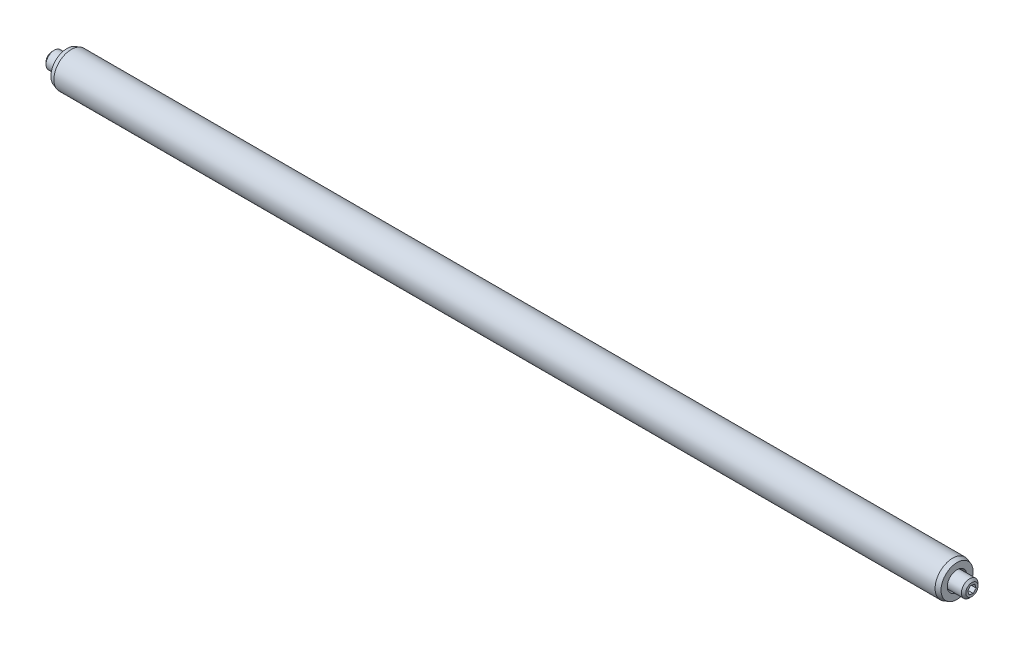
ISO-10303-21;
HEADER;
FILE_DESCRIPTION(('STEP AP214'),'2;1');
FILE_NAME('part.step','',(''),(''),'','','');
FILE_SCHEMA(('AUTOMOTIVE_DESIGN { 1 0 10303 214 1 1 1 1 }'));
ENDSEC;
DATA;
#1=APPLICATION_CONTEXT('core data for automotive mechanical design processes');
#2=APPLICATION_PROTOCOL_DEFINITION('international standard','automotive_design',2000,#1);
#3=PRODUCT_CONTEXT('',#1,'mechanical');
#4=PRODUCT('Part','Part','',(#3));
#5=PRODUCT_RELATED_PRODUCT_CATEGORY('part','',(#4));
#6=PRODUCT_DEFINITION_FORMATION('','',#4);
#7=PRODUCT_DEFINITION_CONTEXT('part definition',#1,'design');
#8=PRODUCT_DEFINITION('design','',#6,#7);
#9=PRODUCT_DEFINITION_SHAPE('','',#8);
#10=(LENGTH_UNIT() NAMED_UNIT(*) SI_UNIT(.MILLI.,.METRE.));
#11=(NAMED_UNIT(*) PLANE_ANGLE_UNIT() SI_UNIT($,.RADIAN.));
#12=(NAMED_UNIT(*) SI_UNIT($,.STERADIAN.) SOLID_ANGLE_UNIT());
#13=UNCERTAINTY_MEASURE_WITH_UNIT(LENGTH_MEASURE(1.E-05),#10,'distance_accuracy_value','');
#14=(GEOMETRIC_REPRESENTATION_CONTEXT(3) GLOBAL_UNCERTAINTY_ASSIGNED_CONTEXT((#13)) GLOBAL_UNIT_ASSIGNED_CONTEXT((#10,
#11,#12)) REPRESENTATION_CONTEXT('',''));
#15=CARTESIAN_POINT('',(0.,0.,0.));
#16=DIRECTION('',(0.,0.,1.));
#17=DIRECTION('',(1.,0.,0.));
#18=AXIS2_PLACEMENT_3D('',#15,#16,#17);
#19=CARTESIAN_POINT('',(-63.7071962136417,18.5557811677768,17.6600868446712));
#20=DIRECTION('',(-1.,0.,0.));
#21=DIRECTION('',(0.,-1.,0.));
#22=AXIS2_PLACEMENT_3D('',#19,#20,#21);
#23=CYLINDRICAL_SURFACE('',#22,2.99974000000001);
#24=CARTESIAN_POINT('',(-62.9451962136417,18.5557811677768,17.6600868446712));
#25=DIRECTION('',(-1.,0.,0.));
#26=DIRECTION('',(0.,-1.,0.));
#27=AXIS2_PLACEMENT_3D('',#24,#25,#26);
#28=CIRCLE('',#27,2.99974000000001);
#29=CARTESIAN_POINT('',(-62.9451962136417,15.5560411677768,17.6600868446712));
#30=VERTEX_POINT('',#29);
#31=EDGE_CURVE('P0_E63',#30,#30,#28,.T.);
#32=ORIENTED_EDGE('',*,*,#31,.F.);
#33=EDGE_LOOP('',(#32));
#34=FACE_BOUND('',#33,.T.);
#35=CARTESIAN_POINT('',(87.9308037863583,18.5557811677768,17.6600868446712));
#36=DIRECTION('',(-1.,0.,0.));
#37=DIRECTION('',(0.,-1.,0.));
#38=AXIS2_PLACEMENT_3D('',#35,#36,#37);
#39=CIRCLE('',#38,2.99974000000001);
#40=CARTESIAN_POINT('',(87.9308037863583,15.5560411677768,17.6600868446712));
#41=VERTEX_POINT('',#40);
#42=EDGE_CURVE('P0_E54',#41,#41,#39,.T.);
#43=ORIENTED_EDGE('',*,*,#42,.T.);
#44=EDGE_LOOP('',(#43));
#45=FACE_BOUND('',#44,.T.);
#46=ADVANCED_FACE('P0_F15',(#34,#45),#23,.T.);
#47=CARTESIAN_POINT('',(-62.9451962136417,18.5557811677768,17.6600868446712));
#48=DIRECTION('',(1.,0.,0.));
#49=DIRECTION('',(0.,1.,0.));
#50=AXIS2_PLACEMENT_3D('',#47,#48,#49);
#51=CONICAL_SURFACE('',#50,2.99974000000001,0.32175055439668);
#52=CARTESIAN_POINT('',(-63.7071962136417,18.5557811677768,17.6600868446712));
#53=DIRECTION('',(-1.,0.,0.));
#54=DIRECTION('',(0.,-1.,0.));
#55=AXIS2_PLACEMENT_3D('',#52,#53,#54);
#56=CIRCLE('',#55,2.74574);
#57=CARTESIAN_POINT('',(-63.7071962136417,15.8100411677768,17.6600868446712));
#58=VERTEX_POINT('',#57);
#59=EDGE_CURVE('P0_E60',#58,#58,#56,.T.);
#60=ORIENTED_EDGE('',*,*,#59,.F.);
#61=EDGE_LOOP('',(#60));
#62=FACE_BOUND('',#61,.T.);
#63=ORIENTED_EDGE('',*,*,#31,.T.);
#64=EDGE_LOOP('',(#63));
#65=FACE_BOUND('',#64,.T.);
#66=ADVANCED_FACE('P0_F91',(#62,#65),#51,.T.);
#67=CARTESIAN_POINT('',(-63.7071962136417,18.5557811677768,17.6600868446712));
#68=DIRECTION('',(1.,0.,0.));
#69=DIRECTION('',(0.,1.,0.));
#70=AXIS2_PLACEMENT_3D('',#67,#68,#69);
#71=PLANE('',#70);
#72=CARTESIAN_POINT('',(-63.7071962136417,18.5557811677768,17.6600868446712));
#73=DIRECTION('',(1.,0.,0.));
#74=DIRECTION('',(0.,1.,0.));
#75=AXIS2_PLACEMENT_3D('',#72,#73,#74);
#76=CIRCLE('',#75,1.67639999999998);
#77=CARTESIAN_POINT('',(-63.7071962136417,20.2321811677768,17.6600868446712));
#78=VERTEX_POINT('',#77);
#79=EDGE_CURVE('P0_E69',#78,#78,#76,.T.);
#80=ORIENTED_EDGE('',*,*,#79,.T.);
#81=EDGE_LOOP('',(#80));
#82=FACE_BOUND('',#81,.T.);
#83=ORIENTED_EDGE('',*,*,#59,.T.);
#84=EDGE_LOOP('',(#83));
#85=FACE_BOUND('',#84,.T.);
#86=ADVANCED_FACE('P0_F97',(#82,#85),#71,.F.);
#87=CARTESIAN_POINT('',(88.6928037863583,18.5557811677768,17.6600868446712));
#88=DIRECTION('',(-1.,0.,0.));
#89=DIRECTION('',(0.,-1.,0.));
#90=AXIS2_PLACEMENT_3D('',#87,#88,#89);
#91=PLANE('',#90);
#92=CARTESIAN_POINT('',(88.6928037863583,18.5557811677768,17.6600868446712));
#93=DIRECTION('',(-1.,0.,0.));
#94=DIRECTION('',(0.,-1.,0.));
#95=AXIS2_PLACEMENT_3D('',#92,#93,#94);
#96=CIRCLE('',#95,1.67639999999998);
#97=CARTESIAN_POINT('',(88.6928037863583,16.8793811677768,17.6600868446712));
#98=VERTEX_POINT('',#97);
#99=EDGE_CURVE('P0_E10',#98,#98,#96,.T.);
#100=ORIENTED_EDGE('',*,*,#99,.T.);
#101=EDGE_LOOP('',(#100));
#102=FACE_BOUND('',#101,.T.);
#103=CARTESIAN_POINT('',(88.6928037863583,18.5557811677768,17.6600868446712));
#104=DIRECTION('',(-1.,0.,0.));
#105=DIRECTION('',(0.,-1.,0.));
#106=AXIS2_PLACEMENT_3D('',#103,#104,#105);
#107=CIRCLE('',#106,2.74574000000001);
#108=CARTESIAN_POINT('',(88.6928037863583,15.8100411677768,17.6600868446712));
#109=VERTEX_POINT('',#108);
#110=EDGE_CURVE('P0_E57',#109,#109,#107,.T.);
#111=ORIENTED_EDGE('',*,*,#110,.F.);
#112=EDGE_LOOP('',(#111));
#113=FACE_BOUND('',#112,.T.);
#114=ADVANCED_FACE('P0_F107',(#102,#113),#91,.F.);
#115=CARTESIAN_POINT('',(88.6928037863583,18.5557811677768,17.6600868446712));
#116=DIRECTION('',(-1.,0.,0.));
#117=DIRECTION('',(0.,-1.,0.));
#118=AXIS2_PLACEMENT_3D('',#115,#116,#117);
#119=CONICAL_SURFACE('',#118,2.74574000000001,0.321750554396653);
#120=ORIENTED_EDGE('',*,*,#42,.F.);
#121=EDGE_LOOP('',(#120));
#122=FACE_BOUND('',#121,.T.);
#123=ORIENTED_EDGE('',*,*,#110,.T.);
#124=EDGE_LOOP('',(#123));
#125=FACE_BOUND('',#124,.T.);
#126=ADVANCED_FACE('P0_F103',(#122,#125),#119,.T.);
#127=CARTESIAN_POINT('',(84.7558037863583,18.5557811677768,17.6600868446712));
#128=DIRECTION('',(1.,0.,0.));
#129=DIRECTION('',(0.,0.,-1.));
#130=AXIS2_PLACEMENT_3D('',#127,#128,#129);
#131=CONICAL_SURFACE('',#130,1.1303,1.02974425867666);
#132=CARTESIAN_POINT('',(84.0766510286715,18.5557811677768,17.6600868446712));
#133=VERTEX_POINT('',#132);
#134=VERTEX_LOOP('',#133);
#135=FACE_BOUND('',#134,.T.);
#136=CARTESIAN_POINT('',(84.7558037863583,18.5557811677768,17.6600868446712));
#137=DIRECTION('',(1.,0.,0.));
#138=DIRECTION('',(0.,0.,-1.));
#139=AXIS2_PLACEMENT_3D('',#136,#137,#138);
#140=CIRCLE('',#139,1.1303);
#141=CARTESIAN_POINT('',(84.7558037863583,18.5557811677768,16.5297868446712));
#142=VERTEX_POINT('',#141);
#143=EDGE_CURVE('P0_E51',#142,#142,#140,.T.);
#144=ORIENTED_EDGE('',*,*,#143,.T.);
#145=EDGE_LOOP('',(#144));
#146=FACE_BOUND('',#145,.T.);
#147=ADVANCED_FACE('P0_F106',(#135,#146),#131,.F.);
#148=CARTESIAN_POINT('',(88.6928037863583,18.5557811677768,17.6600868446712));
#149=DIRECTION('',(1.,0.,0.));
#150=DIRECTION('',(0.,0.,-1.));
#151=AXIS2_PLACEMENT_3D('',#148,#149,#150);
#152=CYLINDRICAL_SURFACE('',#151,1.1303);
#153=ORIENTED_EDGE('',*,*,#143,.F.);
#154=EDGE_LOOP('',(#153));
#155=FACE_BOUND('',#154,.T.);
#156=CARTESIAN_POINT('',(84.8828037863583,18.5557811677768,17.6600868446712));
#157=DIRECTION('',(1.,0.,0.));
#158=DIRECTION('',(0.,0.,-1.));
#159=AXIS2_PLACEMENT_3D('',#156,#157,#158);
#160=CIRCLE('',#159,1.1303);
#161=CARTESIAN_POINT('',(84.8828037863583,18.5557811677768,16.5297868446712));
#162=VERTEX_POINT('',#161);
#163=EDGE_CURVE('P0_E42',#162,#162,#160,.T.);
#164=ORIENTED_EDGE('',*,*,#163,.T.);
#165=EDGE_LOOP('',(#164));
#166=FACE_BOUND('',#165,.T.);
#167=ADVANCED_FACE('P0_F123',(#155,#166),#152,.F.);
#168=CARTESIAN_POINT('',(84.8828037863583,19.6860811677768,17.6600868446712));
#169=DIRECTION('',(-1.,0.,0.));
#170=DIRECTION('',(0.,0.,1.));
#171=AXIS2_PLACEMENT_3D('',#168,#169,#170);
#172=PLANE('',#171);
#173=ORIENTED_EDGE('',*,*,#163,.F.);
#174=EDGE_LOOP('',(#173));
#175=FACE_BOUND('',#174,.T.);
#176=CARTESIAN_POINT('',(84.8828037863583,18.5557811677768,17.6600868446712));
#177=DIRECTION('',(1.,0.,0.));
#178=DIRECTION('',(0.,0.,-1.));
#179=AXIS2_PLACEMENT_3D('',#176,#177,#178);
#180=CIRCLE('',#179,1.4224);
#181=CARTESIAN_POINT('',(84.8828037863583,18.5557811677768,16.2376868446712));
#182=VERTEX_POINT('',#181);
#183=EDGE_CURVE('P0_E38',#182,#182,#180,.T.);
#184=ORIENTED_EDGE('',*,*,#183,.T.);
#185=EDGE_LOOP('',(#184));
#186=FACE_BOUND('',#185,.T.);
#187=ADVANCED_FACE('P0_F126',(#175,#186),#172,.F.);
#188=CARTESIAN_POINT('',(88.6928037863583,18.5557811677768,17.6600868446712));
#189=DIRECTION('',(1.,0.,0.));
#190=DIRECTION('',(0.,0.,-1.));
#191=AXIS2_PLACEMENT_3D('',#188,#189,#190);
#192=CYLINDRICAL_SURFACE('',#191,1.4224);
#193=CARTESIAN_POINT('',(88.2528628812358,18.5557811677768,17.6600868446712));
#194=DIRECTION('',(-1.,0.,0.));
#195=DIRECTION('',(0.,0.,1.));
#196=AXIS2_PLACEMENT_3D('',#193,#194,#195);
#197=CIRCLE('',#196,1.4224);
#198=CARTESIAN_POINT('',(88.2528628812358,18.5557811677768,19.0824868446712));
#199=VERTEX_POINT('',#198);
#200=EDGE_CURVE('P0_E22',#199,#199,#197,.F.);
#201=ORIENTED_EDGE('',*,*,#200,.T.);
#202=EDGE_LOOP('',(#201));
#203=FACE_BOUND('',#202,.T.);
#204=ORIENTED_EDGE('',*,*,#183,.F.);
#205=EDGE_LOOP('',(#204));
#206=FACE_BOUND('',#205,.T.);
#207=ADVANCED_FACE('P0_F32',(#203,#206),#192,.F.);
#208=CARTESIAN_POINT('',(-59.7701962136417,18.5557811677768,17.6600868446712));
#209=DIRECTION('',(-1.,0.,0.));
#210=DIRECTION('',(0.,0.,1.));
#211=AXIS2_PLACEMENT_3D('',#208,#209,#210);
#212=CONICAL_SURFACE('',#211,1.1303,1.02974425867665);
#213=CARTESIAN_POINT('',(-59.0910434559548,18.5557811677768,17.6600868446712));
#214=VERTEX_POINT('',#213);
#215=VERTEX_LOOP('',#214);
#216=FACE_BOUND('',#215,.T.);
#217=CARTESIAN_POINT('',(-59.7701962136417,18.5557811677768,17.6600868446712));
#218=DIRECTION('',(-1.,0.,0.));
#219=DIRECTION('',(0.,0.,1.));
#220=AXIS2_PLACEMENT_3D('',#217,#218,#219);
#221=CIRCLE('',#220,1.1303);
#222=CARTESIAN_POINT('',(-59.7701962136417,18.5557811677768,18.7903868446712));
#223=VERTEX_POINT('',#222);
#224=EDGE_CURVE('P0_E36',#223,#223,#221,.T.);
#225=ORIENTED_EDGE('',*,*,#224,.T.);
#226=EDGE_LOOP('',(#225));
#227=FACE_BOUND('',#226,.T.);
#228=ADVANCED_FACE('P0_F28',(#216,#227),#212,.F.);
#229=CARTESIAN_POINT('',(-63.7071962136417,18.5557811677768,17.6600868446712));
#230=DIRECTION('',(-1.,0.,0.));
#231=DIRECTION('',(0.,0.,1.));
#232=AXIS2_PLACEMENT_3D('',#229,#230,#231);
#233=CYLINDRICAL_SURFACE('',#232,1.1303);
#234=ORIENTED_EDGE('',*,*,#224,.F.);
#235=EDGE_LOOP('',(#234));
#236=FACE_BOUND('',#235,.T.);
#237=CARTESIAN_POINT('',(-59.8971962136417,18.5557811677768,17.6600868446712));
#238=DIRECTION('',(-1.,0.,0.));
#239=DIRECTION('',(0.,0.,1.));
#240=AXIS2_PLACEMENT_3D('',#237,#238,#239);
#241=CIRCLE('',#240,1.1303);
#242=CARTESIAN_POINT('',(-59.8971962136417,18.5557811677768,18.7903868446712));
#243=VERTEX_POINT('',#242);
#244=EDGE_CURVE('P0_E39',#243,#243,#241,.T.);
#245=ORIENTED_EDGE('',*,*,#244,.T.);
#246=EDGE_LOOP('',(#245));
#247=FACE_BOUND('',#246,.T.);
#248=ADVANCED_FACE('P0_F31',(#236,#247),#233,.F.);
#249=CARTESIAN_POINT('',(-59.8971962136417,19.6860811677768,17.6600868446712));
#250=DIRECTION('',(1.,0.,0.));
#251=DIRECTION('',(0.,0.,-1.));
#252=AXIS2_PLACEMENT_3D('',#249,#250,#251);
#253=PLANE('',#252);
#254=ORIENTED_EDGE('',*,*,#244,.F.);
#255=EDGE_LOOP('',(#254));
#256=FACE_BOUND('',#255,.T.);
#257=CARTESIAN_POINT('',(-59.8971962136417,18.5557811677768,17.6600868446712));
#258=DIRECTION('',(-1.,0.,0.));
#259=DIRECTION('',(0.,0.,1.));
#260=AXIS2_PLACEMENT_3D('',#257,#258,#259);
#261=CIRCLE('',#260,1.4224);
#262=CARTESIAN_POINT('',(-59.8971962136417,18.5557811677768,19.0824868446712));
#263=VERTEX_POINT('',#262);
#264=EDGE_CURVE('P0_E45',#263,#263,#261,.T.);
#265=ORIENTED_EDGE('',*,*,#264,.T.);
#266=EDGE_LOOP('',(#265));
#267=FACE_BOUND('',#266,.T.);
#268=ADVANCED_FACE('P0_F135',(#256,#267),#253,.F.);
#269=CARTESIAN_POINT('',(-63.7071962136417,18.5557811677768,17.6600868446712));
#270=DIRECTION('',(-1.,0.,0.));
#271=DIRECTION('',(0.,0.,1.));
#272=AXIS2_PLACEMENT_3D('',#269,#270,#271);
#273=CYLINDRICAL_SURFACE('',#272,1.4224);
#274=CARTESIAN_POINT('',(-63.2672553085192,18.5557811677768,17.6600868446712));
#275=DIRECTION('',(1.,0.,0.));
#276=DIRECTION('',(0.,0.,-1.));
#277=AXIS2_PLACEMENT_3D('',#274,#275,#276);
#278=CIRCLE('',#277,1.4224);
#279=CARTESIAN_POINT('',(-63.2672553085192,18.5557811677768,16.2376868446712));
#280=VERTEX_POINT('',#279);
#281=EDGE_CURVE('P0_E66',#280,#280,#278,.F.);
#282=ORIENTED_EDGE('',*,*,#281,.T.);
#283=EDGE_LOOP('',(#282));
#284=FACE_BOUND('',#283,.T.);
#285=ORIENTED_EDGE('',*,*,#264,.F.);
#286=EDGE_LOOP('',(#285));
#287=FACE_BOUND('',#286,.T.);
#288=ADVANCED_FACE('P0_F86',(#284,#287),#273,.F.);
#289=CARTESIAN_POINT('',(-63.2672553085192,18.5557811677768,17.6600868446712));
#290=DIRECTION('',(-1.,0.,0.));
#291=DIRECTION('',(0.,0.,1.));
#292=AXIS2_PLACEMENT_3D('',#289,#290,#291);
#293=CONICAL_SURFACE('',#292,1.4224,0.523598775598301);
#294=ORIENTED_EDGE('',*,*,#79,.F.);
#295=EDGE_LOOP('',(#294));
#296=FACE_BOUND('',#295,.T.);
#297=ORIENTED_EDGE('',*,*,#281,.F.);
#298=EDGE_LOOP('',(#297));
#299=FACE_BOUND('',#298,.T.);
#300=ADVANCED_FACE('P0_F78',(#296,#299),#293,.F.);
#301=CARTESIAN_POINT('',(88.2528628812358,18.5557811677768,17.6600868446712));
#302=DIRECTION('',(1.,0.,0.));
#303=DIRECTION('',(0.,0.,-1.));
#304=AXIS2_PLACEMENT_3D('',#301,#302,#303);
#305=CONICAL_SURFACE('',#304,1.4224,0.52359877559829);
#306=ORIENTED_EDGE('',*,*,#99,.F.);
#307=EDGE_LOOP('',(#306));
#308=FACE_BOUND('',#307,.T.);
#309=ORIENTED_EDGE('',*,*,#200,.F.);
#310=EDGE_LOOP('',(#309));
#311=FACE_BOUND('',#310,.T.);
#312=ADVANCED_FACE('P0_F76',(#308,#311),#305,.F.);
#313=CLOSED_SHELL('',(#46,#66,#86,#114,#126,#147,#167,#187,#207,#228,#248,#268,#288,#300,#312));
#314=MANIFOLD_SOLID_BREP('P0_B1',#313);
#315=CARTESIAN_POINT('',(-66.2471962136417,18.5557811677768,17.6600868446712));
#316=DIRECTION('',(-1.,0.,0.));
#317=DIRECTION('',(0.,0.707340933782733,0.706872551026967));
#318=AXIS2_PLACEMENT_3D('',#315,#316,#317);
#319=PLANE('',#318);
#320=CARTESIAN_POINT('',(-66.2471962136417,18.5557811677768,17.6600868446712));
#321=DIRECTION('',(-1.,0.,0.));
#322=DIRECTION('',(0.,0.707340933782733,0.706872551026967));
#323=AXIS2_PLACEMENT_3D('',#320,#321,#322);
#324=CIRCLE('',#323,1.04394);
#325=CARTESIAN_POINT('',(-66.2471962136417,19.2942026621899,18.3980193755903));
#326=VERTEX_POINT('',#325);
#327=EDGE_CURVE('P1_E11',#326,#326,#324,.T.);
#328=ORIENTED_EDGE('',*,*,#327,.T.);
#329=EDGE_LOOP('',(#328));
#330=FACE_BOUND('',#329,.T.);
#331=DIRECTION('',(0.,-0.707340933782733,-0.706872551026967));
#332=VECTOR('',#331,1.);
#333=CARTESIAN_POINT('',(-66.2471962136417,19.2639687465444,17.4700771433067));
#334=LINE('',#333,#332);
#335=CARTESIAN_POINT('',(-66.2471962136417,19.2639687465444,17.4700771433067));
#336=VERTEX_POINT('',#335);
#337=CARTESIAN_POINT('',(-66.2471962136417,18.7453217288134,16.9517735601316));
#338=VERTEX_POINT('',#337);
#339=EDGE_CURVE('P1_E88',#336,#338,#334,.T.);
#340=ORIENTED_EDGE('',*,*,#339,.F.);
#341=DIRECTION('',(0.,-0.2584991195359,0.966011493305936));
#342=VECTOR('',#341,1.);
#343=CARTESIAN_POINT('',(-66.2471962136417,19.2639687465444,17.4700771433067));
#344=LINE('',#343,#342);
#345=CARTESIAN_POINT('',(-66.2471962136417,19.0744281855077,18.1783904278463));
#346=VERTEX_POINT('',#345);
#347=EDGE_CURVE('P1_E30',#336,#346,#344,.T.);
#348=ORIENTED_EDGE('',*,*,#347,.T.);
#349=DIRECTION('',(0.,0.965840053318632,-0.259138942278969));
#350=VECTOR('',#349,1.);
#351=CARTESIAN_POINT('',(-66.2471962136417,18.3662406067401,18.3684001292108));
#352=LINE('',#351,#350);
#353=CARTESIAN_POINT('',(-66.2471962136417,18.3662406067401,18.3684001292108));
#354=VERTEX_POINT('',#353);
#355=EDGE_CURVE('P1_E78',#354,#346,#352,.T.);
#356=ORIENTED_EDGE('',*,*,#355,.F.);
#357=DIRECTION('',(0.,-0.707340933782733,-0.706872551026967));
#358=VECTOR('',#357,1.);
#359=CARTESIAN_POINT('',(-66.2471962136417,18.3662406067401,18.3684001292108));
#360=LINE('',#359,#358);
#361=CARTESIAN_POINT('',(-66.2471962136417,17.8475935890092,17.8500965460357));
#362=VERTEX_POINT('',#361);
#363=EDGE_CURVE('P1_E83',#354,#362,#360,.T.);
#364=ORIENTED_EDGE('',*,*,#363,.T.);
#365=DIRECTION('',(0.,0.258499119535899,-0.966011493305936));
#366=VECTOR('',#365,1.);
#367=CARTESIAN_POINT('',(-66.2471962136417,17.8475935890092,17.8500965460357));
#368=LINE('',#367,#366);
#369=CARTESIAN_POINT('',(-66.2471962136417,18.0371341500458,17.1417832614961));
#370=VERTEX_POINT('',#369);
#371=EDGE_CURVE('P1_E92',#362,#370,#368,.T.);
#372=ORIENTED_EDGE('',*,*,#371,.T.);
#373=DIRECTION('',(0.,-0.965840053318632,0.259138942278969));
#374=VECTOR('',#373,1.);
#375=CARTESIAN_POINT('',(-66.2471962136417,18.7453217288134,16.9517735601316));
#376=LINE('',#375,#374);
#377=EDGE_CURVE('P1_E95',#338,#370,#376,.T.);
#378=ORIENTED_EDGE('',*,*,#377,.F.);
#379=EDGE_LOOP('',(#340,#348,#356,#364,#372,#378));
#380=FACE_BOUND('',#379,.T.);
#381=ADVANCED_FACE('P1_F16',(#330,#380),#319,.T.);
#382=CARTESIAN_POINT('',(-66.2471962136417,18.5557811677768,17.6600868446712));
#383=DIRECTION('',(1.,0.,0.));
#384=DIRECTION('',(0.,-0.707340933782733,-0.706872551026967));
#385=AXIS2_PLACEMENT_3D('',#382,#383,#384);
#386=CONICAL_SURFACE('',#385,1.04394,0.785398163397424);
#387=CARTESIAN_POINT('',(-65.8687362136417,18.5557811677768,17.6600868446712));
#388=DIRECTION('',(-1.,0.,0.));
#389=DIRECTION('',(0.,0.707340933782733,0.706872551026967));
#390=AXIS2_PLACEMENT_3D('',#387,#388,#389);
#391=CIRCLE('',#390,1.4224);
#392=CARTESIAN_POINT('',(-65.8687362136417,19.5619029119893,18.665542361252));
#393=VERTEX_POINT('',#392);
#394=EDGE_CURVE('P1_E23',#393,#393,#391,.T.);
#395=ORIENTED_EDGE('',*,*,#394,.T.);
#396=EDGE_LOOP('',(#395));
#397=FACE_BOUND('',#396,.T.);
#398=ORIENTED_EDGE('',*,*,#327,.F.);
#399=EDGE_LOOP('',(#398));
#400=FACE_BOUND('',#399,.T.);
#401=ADVANCED_FACE('P1_F128',(#397,#400),#386,.T.);
#402=CARTESIAN_POINT('',(-78.9471962136417,18.5557811677768,17.6600868446712));
#403=DIRECTION('',(-1.,0.,0.));
#404=DIRECTION('',(0.,0.707340933782733,0.706872551026967));
#405=AXIS2_PLACEMENT_3D('',#402,#403,#404);
#406=CYLINDRICAL_SURFACE('',#405,1.4224);
#407=CARTESIAN_POINT('',(-62.1323962136417,18.5557811677768,17.6600868446712));
#408=DIRECTION('',(-1.,0.,0.));
#409=DIRECTION('',(0.,0.707340933782733,0.706872551026967));
#410=AXIS2_PLACEMENT_3D('',#407,#408,#409);
#411=CIRCLE('',#410,1.4224);
#412=CARTESIAN_POINT('',(-62.1323962136417,19.5619029119893,18.665542361252));
#413=VERTEX_POINT('',#412);
#414=EDGE_CURVE('P1_E123',#413,#413,#411,.T.);
#415=ORIENTED_EDGE('',*,*,#414,.T.);
#416=EDGE_LOOP('',(#415));
#417=FACE_BOUND('',#416,.T.);
#418=ORIENTED_EDGE('',*,*,#394,.F.);
#419=EDGE_LOOP('',(#418));
#420=FACE_BOUND('',#419,.T.);
#421=ADVANCED_FACE('P1_F131',(#417,#420),#406,.T.);
#422=CARTESIAN_POINT('',(-62.1323962136417,18.5557811677768,17.6600868446712));
#423=DIRECTION('',(-1.,0.,0.));
#424=DIRECTION('',(0.,0.707340933782733,0.706872551026967));
#425=AXIS2_PLACEMENT_3D('',#422,#423,#424);
#426=CONICAL_SURFACE('',#425,1.4224,0.785398163397458);
#427=CARTESIAN_POINT('',(-61.4846962136417,18.5557811677768,17.6600868446712));
#428=DIRECTION('',(-1.,0.,0.));
#429=DIRECTION('',(0.,0.707340933782733,0.706872551026967));
#430=AXIS2_PLACEMENT_3D('',#427,#428,#429);
#431=CIRCLE('',#430,0.7747);
#432=CARTESIAN_POINT('',(-61.4846962136417,19.1037581891783,18.2077010099518));
#433=VERTEX_POINT('',#432);
#434=EDGE_CURVE('P1_E74',#433,#433,#431,.T.);
#435=ORIENTED_EDGE('',*,*,#434,.T.);
#436=EDGE_LOOP('',(#435));
#437=FACE_BOUND('',#436,.T.);
#438=ORIENTED_EDGE('',*,*,#414,.F.);
#439=EDGE_LOOP('',(#438));
#440=FACE_BOUND('',#439,.T.);
#441=ADVANCED_FACE('P1_F133',(#437,#440),#426,.T.);
#442=CARTESIAN_POINT('',(-61.9501829352023,18.5557811677768,17.6600868446712));
#443=DIRECTION('',(1.,0.,0.));
#444=DIRECTION('',(0.,-0.707340933782733,-0.706872551026967));
#445=AXIS2_PLACEMENT_3D('',#442,#443,#444);
#446=CONICAL_SURFACE('',#445,0.,1.02974425867666);
#447=ORIENTED_EDGE('',*,*,#434,.F.);
#448=EDGE_LOOP('',(#447));
#449=FACE_BOUND('',#448,.T.);
#450=CARTESIAN_POINT('',(-61.9501829352023,18.5557811677768,17.6600868446712));
#451=VERTEX_POINT('',#450);
#452=VERTEX_LOOP('',#451);
#453=FACE_BOUND('',#452,.T.);
#454=ADVANCED_FACE('P1_F142',(#449,#453),#446,.F.);
#455=CARTESIAN_POINT('',(-64.4691962136417,19.2639687465444,17.4700771433067));
#456=DIRECTION('',(0.,-0.966011493305936,-0.2584991195359));
#457=DIRECTION('',(0.,0.2584991195359,-0.966011493305936));
#458=AXIS2_PLACEMENT_3D('',#455,#456,#457);
#459=PLANE('',#458);
#460=ORIENTED_EDGE('',*,*,#347,.F.);
#461=DIRECTION('',(-1.,0.,0.));
#462=VECTOR('',#461,1.);
#463=CARTESIAN_POINT('',(-64.4691962136417,19.2639687465444,17.4700771433067));
#464=LINE('',#463,#462);
#465=CARTESIAN_POINT('',(-64.4691962136417,19.2639687465444,17.4700771433067));
#466=VERTEX_POINT('',#465);
#467=EDGE_CURVE('P1_E112',#466,#336,#464,.T.);
#468=ORIENTED_EDGE('',*,*,#467,.F.);
#469=DIRECTION('',(0.,-0.2584991195359,0.966011493305936));
#470=VECTOR('',#469,1.);
#471=CARTESIAN_POINT('',(-64.4691962136417,19.2639687465444,17.4700771433067));
#472=LINE('',#471,#470);
#473=CARTESIAN_POINT('',(-64.4691962136417,19.0744281855077,18.1783904278463));
#474=VERTEX_POINT('',#473);
#475=EDGE_CURVE('P1_E70',#466,#474,#472,.T.);
#476=ORIENTED_EDGE('',*,*,#475,.T.);
#477=DIRECTION('',(-1.,0.,0.));
#478=VECTOR('',#477,1.);
#479=CARTESIAN_POINT('',(-64.4691962136417,19.0744281855077,18.1783904278463));
#480=LINE('',#479,#478);
#481=EDGE_CURVE('P1_E66',#474,#346,#480,.T.);
#482=ORIENTED_EDGE('',*,*,#481,.T.);
#483=EDGE_LOOP('',(#460,#468,#476,#482));
#484=FACE_BOUND('',#483,.T.);
#485=ADVANCED_FACE('P1_F68',(#484),#459,.T.);
#486=CARTESIAN_POINT('',(-64.4691962136417,18.3662406067401,18.3684001292108));
#487=DIRECTION('',(0.,0.259138942278969,0.965840053318632));
#488=DIRECTION('',(0.,-0.965840053318632,0.259138942278969));
#489=AXIS2_PLACEMENT_3D('',#486,#487,#488);
#490=PLANE('',#489);
#491=ORIENTED_EDGE('',*,*,#355,.T.);
#492=ORIENTED_EDGE('',*,*,#481,.F.);
#493=DIRECTION('',(0.,0.965840053318632,-0.259138942278969));
#494=VECTOR('',#493,1.);
#495=CARTESIAN_POINT('',(-64.4691962136417,18.3662406067401,18.3684001292108));
#496=LINE('',#495,#494);
#497=CARTESIAN_POINT('',(-64.4691962136417,18.3662406067401,18.3684001292108));
#498=VERTEX_POINT('',#497);
#499=EDGE_CURVE('P1_E100',#498,#474,#496,.T.);
#500=ORIENTED_EDGE('',*,*,#499,.F.);
#501=DIRECTION('',(-1.,0.,0.));
#502=VECTOR('',#501,1.);
#503=CARTESIAN_POINT('',(-64.4691962136417,18.3662406067401,18.3684001292108));
#504=LINE('',#503,#502);
#505=EDGE_CURVE('P1_E75',#498,#354,#504,.T.);
#506=ORIENTED_EDGE('',*,*,#505,.T.);
#507=EDGE_LOOP('',(#491,#492,#500,#506));
#508=FACE_BOUND('',#507,.T.);
#509=ADVANCED_FACE('P1_F79',(#508),#490,.F.);
#510=CARTESIAN_POINT('',(-64.4691962136417,18.3662406067401,18.3684001292108));
#511=DIRECTION('',(0.,0.706872551026967,-0.707340933782733));
#512=DIRECTION('',(0.,0.707340933782733,0.706872551026967));
#513=AXIS2_PLACEMENT_3D('',#510,#511,#512);
#514=PLANE('',#513);
#515=ORIENTED_EDGE('',*,*,#363,.F.);
#516=ORIENTED_EDGE('',*,*,#505,.F.);
#517=DIRECTION('',(0.,-0.707340933782733,-0.706872551026967));
#518=VECTOR('',#517,1.);
#519=CARTESIAN_POINT('',(-64.4691962136417,18.3662406067401,18.3684001292108));
#520=LINE('',#519,#518);
#521=CARTESIAN_POINT('',(-64.4691962136417,17.8475935890092,17.8500965460357));
#522=VERTEX_POINT('',#521);
#523=EDGE_CURVE('P1_E102',#498,#522,#520,.T.);
#524=ORIENTED_EDGE('',*,*,#523,.T.);
#525=DIRECTION('',(-1.,0.,0.));
#526=VECTOR('',#525,1.);
#527=CARTESIAN_POINT('',(-64.4691962136417,17.8475935890092,17.8500965460357));
#528=LINE('',#527,#526);
#529=EDGE_CURVE('P1_E118',#522,#362,#528,.T.);
#530=ORIENTED_EDGE('',*,*,#529,.T.);
#531=EDGE_LOOP('',(#515,#516,#524,#530));
#532=FACE_BOUND('',#531,.T.);
#533=ADVANCED_FACE('P1_F213',(#532),#514,.T.);
#534=CARTESIAN_POINT('',(-64.4691962136417,17.8475935890092,17.8500965460357));
#535=DIRECTION('',(0.,0.966011493305936,0.258499119535899));
#536=DIRECTION('',(0.,-0.258499119535899,0.966011493305936));
#537=AXIS2_PLACEMENT_3D('',#534,#535,#536);
#538=PLANE('',#537);
#539=ORIENTED_EDGE('',*,*,#371,.F.);
#540=ORIENTED_EDGE('',*,*,#529,.F.);
#541=DIRECTION('',(0.,0.258499119535899,-0.966011493305936));
#542=VECTOR('',#541,1.);
#543=CARTESIAN_POINT('',(-64.4691962136417,17.8475935890092,17.8500965460357));
#544=LINE('',#543,#542);
#545=CARTESIAN_POINT('',(-64.4691962136417,18.0371341500458,17.1417832614961));
#546=VERTEX_POINT('',#545);
#547=EDGE_CURVE('P1_E104',#522,#546,#544,.T.);
#548=ORIENTED_EDGE('',*,*,#547,.T.);
#549=DIRECTION('',(-1.,0.,0.));
#550=VECTOR('',#549,1.);
#551=CARTESIAN_POINT('',(-64.4691962136417,18.0371341500458,17.1417832614961));
#552=LINE('',#551,#550);
#553=EDGE_CURVE('P1_E116',#546,#370,#552,.T.);
#554=ORIENTED_EDGE('',*,*,#553,.T.);
#555=EDGE_LOOP('',(#539,#540,#548,#554));
#556=FACE_BOUND('',#555,.T.);
#557=ADVANCED_FACE('P1_F224',(#556),#538,.T.);
#558=CARTESIAN_POINT('',(-64.4691962136417,18.7453217288134,16.9517735601316));
#559=DIRECTION('',(0.,-0.259138942278969,-0.965840053318632));
#560=DIRECTION('',(0.,0.965840053318632,-0.259138942278969));
#561=AXIS2_PLACEMENT_3D('',#558,#559,#560);
#562=PLANE('',#561);
#563=ORIENTED_EDGE('',*,*,#377,.T.);
#564=ORIENTED_EDGE('',*,*,#553,.F.);
#565=DIRECTION('',(0.,-0.965840053318632,0.259138942278969));
#566=VECTOR('',#565,1.);
#567=CARTESIAN_POINT('',(-64.4691962136417,18.7453217288134,16.9517735601316));
#568=LINE('',#567,#566);
#569=CARTESIAN_POINT('',(-64.4691962136417,18.7453217288134,16.9517735601316));
#570=VERTEX_POINT('',#569);
#571=EDGE_CURVE('P1_E106',#570,#546,#568,.T.);
#572=ORIENTED_EDGE('',*,*,#571,.F.);
#573=DIRECTION('',(-1.,0.,0.));
#574=VECTOR('',#573,1.);
#575=CARTESIAN_POINT('',(-64.4691962136417,18.7453217288134,16.9517735601316));
#576=LINE('',#575,#574);
#577=EDGE_CURVE('P1_E114',#570,#338,#576,.T.);
#578=ORIENTED_EDGE('',*,*,#577,.T.);
#579=EDGE_LOOP('',(#563,#564,#572,#578));
#580=FACE_BOUND('',#579,.T.);
#581=ADVANCED_FACE('P1_F236',(#580),#562,.F.);
#582=CARTESIAN_POINT('',(-64.4691962136417,19.2639687465444,17.4700771433067));
#583=DIRECTION('',(0.,0.706872551026967,-0.707340933782733));
#584=DIRECTION('',(0.,0.707340933782733,0.706872551026967));
#585=AXIS2_PLACEMENT_3D('',#582,#583,#584);
#586=PLANE('',#585);
#587=ORIENTED_EDGE('',*,*,#339,.T.);
#588=ORIENTED_EDGE('',*,*,#577,.F.);
#589=DIRECTION('',(0.,-0.707340933782733,-0.706872551026967));
#590=VECTOR('',#589,1.);
#591=CARTESIAN_POINT('',(-64.4691962136417,19.2639687465444,17.4700771433067));
#592=LINE('',#591,#590);
#593=EDGE_CURVE('P1_E109',#466,#570,#592,.T.);
#594=ORIENTED_EDGE('',*,*,#593,.F.);
#595=ORIENTED_EDGE('',*,*,#467,.T.);
#596=EDGE_LOOP('',(#587,#588,#594,#595));
#597=FACE_BOUND('',#596,.T.);
#598=ADVANCED_FACE('P1_F247',(#597),#586,.F.);
#599=CARTESIAN_POINT('',(-64.4691962136417,19.2639687465444,17.4700771433067));
#600=DIRECTION('',(1.,0.,0.));
#601=DIRECTION('',(0.,-0.707340933782733,-0.706872551026967));
#602=AXIS2_PLACEMENT_3D('',#599,#600,#601);
#603=PLANE('',#602);
#604=ORIENTED_EDGE('',*,*,#475,.F.);
#605=ORIENTED_EDGE('',*,*,#593,.T.);
#606=ORIENTED_EDGE('',*,*,#571,.T.);
#607=ORIENTED_EDGE('',*,*,#547,.F.);
#608=ORIENTED_EDGE('',*,*,#523,.F.);
#609=ORIENTED_EDGE('',*,*,#499,.T.);
#610=EDGE_LOOP('',(#604,#605,#606,#607,#608,#609));
#611=FACE_BOUND('',#610,.T.);
#612=ADVANCED_FACE('P1_F159',(#611),#603,.F.);
#613=CLOSED_SHELL('',(#381,#401,#421,#441,#454,#485,#509,#533,#557,#581,#598,#612));
#614=MANIFOLD_SOLID_BREP('P1_B1',#613);
#615=CARTESIAN_POINT('',(91.2328037863583,18.5557811677768,17.6600868446712));
#616=DIRECTION('',(1.,0.,0.));
#617=DIRECTION('',(0.,-0.948784697903667,-0.315923403729207));
#618=AXIS2_PLACEMENT_3D('',#615,#616,#617);
#619=PLANE('',#618);
#620=CARTESIAN_POINT('',(91.2328037863583,18.5557811677768,17.6600868446712));
#621=DIRECTION('',(1.,0.,0.));
#622=DIRECTION('',(0.,-0.948784697903667,-0.315923403729207));
#623=AXIS2_PLACEMENT_3D('',#620,#621,#622);
#624=CIRCLE('',#623,1.04394);
#625=CARTESIAN_POINT('',(91.2328037863583,17.5653068702472,17.3302817665822));
#626=VERTEX_POINT('',#625);
#627=EDGE_CURVE('P2_E10',#626,#626,#624,.T.);
#628=ORIENTED_EDGE('',*,*,#627,.T.);
#629=EDGE_LOOP('',(#628));
#630=FACE_BOUND('',#629,.T.);
#631=DIRECTION('',(0.,0.948784697903667,0.315923403729207));
#632=VECTOR('',#631,1.);
#633=CARTESIAN_POINT('',(91.2328037863583,18.4085515301764,16.9417855380141));
#634=LINE('',#633,#632);
#635=CARTESIAN_POINT('',(91.2328037863583,18.4085515301764,16.9417855380141));
#636=VERTEX_POINT('',#635);
#637=CARTESIAN_POINT('',(91.2328037863583,19.1042335281133,17.1734315849907));
#638=VERTEX_POINT('',#637);
#639=EDGE_CURVE('P2_E87',#636,#638,#634,.T.);
#640=ORIENTED_EDGE('',*,*,#639,.F.);
#641=DIRECTION('',(0.,-0.747990042231374,0.663709949241917));
#642=VECTOR('',#641,1.);
#643=CARTESIAN_POINT('',(91.2328037863583,18.4085515301764,16.9417855380141));
#644=LINE('',#643,#642);
#645=CARTESIAN_POINT('',(91.2328037863583,17.8600991698399,17.4284407976946));
#646=VERTEX_POINT('',#645);
#647=EDGE_CURVE('P2_E29',#636,#646,#644,.T.);
#648=ORIENTED_EDGE('',*,*,#647,.T.);
#649=DIRECTION('',(0.,-0.200794655672292,-0.979633352971124));
#650=VECTOR('',#649,1.);
#651=CARTESIAN_POINT('',(91.2328037863583,18.0073288074403,18.1467421043517));
#652=LINE('',#651,#650);
#653=CARTESIAN_POINT('',(91.2328037863583,18.0073288074403,18.1467421043517));
#654=VERTEX_POINT('',#653);
#655=EDGE_CURVE('P2_E77',#654,#646,#652,.T.);
#656=ORIENTED_EDGE('',*,*,#655,.F.);
#657=DIRECTION('',(0.,0.948784697903667,0.315923403729207));
#658=VECTOR('',#657,1.);
#659=CARTESIAN_POINT('',(91.2328037863583,18.0073288074403,18.1467421043517));
#660=LINE('',#659,#658);
#661=CARTESIAN_POINT('',(91.2328037863583,18.7030108053772,18.3783881513284));
#662=VERTEX_POINT('',#661);
#663=EDGE_CURVE('P2_E82',#654,#662,#660,.T.);
#664=ORIENTED_EDGE('',*,*,#663,.T.);
#665=DIRECTION('',(0.,0.747990042231374,-0.663709949241916));
#666=VECTOR('',#665,1.);
#667=CARTESIAN_POINT('',(91.2328037863583,18.7030108053772,18.3783881513284));
#668=LINE('',#667,#666);
#669=CARTESIAN_POINT('',(91.2328037863583,19.2514631657136,17.8917328916479));
#670=VERTEX_POINT('',#669);
#671=EDGE_CURVE('P2_E91',#662,#670,#668,.T.);
#672=ORIENTED_EDGE('',*,*,#671,.T.);
#673=DIRECTION('',(0.,0.200794655672293,0.979633352971124));
#674=VECTOR('',#673,1.);
#675=CARTESIAN_POINT('',(91.2328037863583,19.1042335281133,17.1734315849907));
#676=LINE('',#675,#674);
#677=EDGE_CURVE('P2_E94',#638,#670,#676,.T.);
#678=ORIENTED_EDGE('',*,*,#677,.F.);
#679=EDGE_LOOP('',(#640,#648,#656,#664,#672,#678));
#680=FACE_BOUND('',#679,.T.);
#681=ADVANCED_FACE('P2_F15',(#630,#680),#619,.T.);
#682=CARTESIAN_POINT('',(91.2328037863583,18.5557811677768,17.6600868446712));
#683=DIRECTION('',(-1.,0.,0.));
#684=DIRECTION('',(0.,0.948784697903667,0.315923403729207));
#685=AXIS2_PLACEMENT_3D('',#682,#683,#684);
#686=CONICAL_SURFACE('',#685,1.04394,0.785398163397424);
#687=CARTESIAN_POINT('',(90.8543437863583,18.5557811677768,17.6600868446712));
#688=DIRECTION('',(1.,0.,0.));
#689=DIRECTION('',(0.,-0.948784697903667,-0.315923403729207));
#690=AXIS2_PLACEMENT_3D('',#687,#688,#689);
#691=CIRCLE('',#690,1.4224);
#692=CARTESIAN_POINT('',(90.8543437863583,17.2062298134786,17.2107173952068));
#693=VERTEX_POINT('',#692);
#694=EDGE_CURVE('P2_E22',#693,#693,#691,.T.);
#695=ORIENTED_EDGE('',*,*,#694,.T.);
#696=EDGE_LOOP('',(#695));
#697=FACE_BOUND('',#696,.T.);
#698=ORIENTED_EDGE('',*,*,#627,.F.);
#699=EDGE_LOOP('',(#698));
#700=FACE_BOUND('',#699,.T.);
#701=ADVANCED_FACE('P2_F127',(#697,#700),#686,.T.);
#702=CARTESIAN_POINT('',(103.932803786358,18.5557811677768,17.6600868446712));
#703=DIRECTION('',(1.,0.,0.));
#704=DIRECTION('',(0.,-0.948784697903667,-0.315923403729207));
#705=AXIS2_PLACEMENT_3D('',#702,#703,#704);
#706=CYLINDRICAL_SURFACE('',#705,1.4224);
#707=CARTESIAN_POINT('',(87.1180037863583,18.5557811677768,17.6600868446712));
#708=DIRECTION('',(1.,0.,0.));
#709=DIRECTION('',(0.,-0.948784697903667,-0.315923403729207));
#710=AXIS2_PLACEMENT_3D('',#707,#708,#709);
#711=CIRCLE('',#710,1.4224);
#712=CARTESIAN_POINT('',(87.1180037863583,17.2062298134786,17.2107173952068));
#713=VERTEX_POINT('',#712);
#714=EDGE_CURVE('P2_E122',#713,#713,#711,.T.);
#715=ORIENTED_EDGE('',*,*,#714,.T.);
#716=EDGE_LOOP('',(#715));
#717=FACE_BOUND('',#716,.T.);
#718=ORIENTED_EDGE('',*,*,#694,.F.);
#719=EDGE_LOOP('',(#718));
#720=FACE_BOUND('',#719,.T.);
#721=ADVANCED_FACE('P2_F130',(#717,#720),#706,.T.);
#722=CARTESIAN_POINT('',(87.1180037863583,18.5557811677768,17.6600868446712));
#723=DIRECTION('',(1.,0.,0.));
#724=DIRECTION('',(0.,-0.948784697903667,-0.315923403729207));
#725=AXIS2_PLACEMENT_3D('',#722,#723,#724);
#726=CONICAL_SURFACE('',#725,1.4224,0.785398163397458);
#727=CARTESIAN_POINT('',(86.4703037863583,18.5557811677768,17.6600868446712));
#728=DIRECTION('',(1.,0.,0.));
#729=DIRECTION('',(0.,-0.948784697903667,-0.315923403729207));
#730=AXIS2_PLACEMENT_3D('',#727,#728,#729);
#731=CIRCLE('',#730,0.7747);
#732=CARTESIAN_POINT('',(86.4703037863583,17.8207576623108,17.4153409838022));
#733=VERTEX_POINT('',#732);
#734=EDGE_CURVE('P2_E73',#733,#733,#731,.T.);
#735=ORIENTED_EDGE('',*,*,#734,.T.);
#736=EDGE_LOOP('',(#735));
#737=FACE_BOUND('',#736,.T.);
#738=ORIENTED_EDGE('',*,*,#714,.F.);
#739=EDGE_LOOP('',(#738));
#740=FACE_BOUND('',#739,.T.);
#741=ADVANCED_FACE('P2_F132',(#737,#740),#726,.T.);
#742=CARTESIAN_POINT('',(86.935790507919,18.5557811677768,17.6600868446712));
#743=DIRECTION('',(-1.,0.,0.));
#744=DIRECTION('',(0.,0.948784697903667,0.315923403729207));
#745=AXIS2_PLACEMENT_3D('',#742,#743,#744);
#746=CONICAL_SURFACE('',#745,0.,1.02974425867666);
#747=ORIENTED_EDGE('',*,*,#734,.F.);
#748=EDGE_LOOP('',(#747));
#749=FACE_BOUND('',#748,.T.);
#750=CARTESIAN_POINT('',(86.935790507919,18.5557811677768,17.6600868446712));
#751=VERTEX_POINT('',#750);
#752=VERTEX_LOOP('',#751);
#753=FACE_BOUND('',#752,.T.);
#754=ADVANCED_FACE('P2_F141',(#749,#753),#746,.F.);
#755=CARTESIAN_POINT('',(89.4548037863583,18.4085515301764,16.9417855380141));
#756=DIRECTION('',(0.,0.663709949241916,0.747990042231374));
#757=DIRECTION('',(0.,0.747990042231374,-0.663709949241917));
#758=AXIS2_PLACEMENT_3D('',#755,#756,#757);
#759=PLANE('',#758);
#760=ORIENTED_EDGE('',*,*,#647,.F.);
#761=DIRECTION('',(1.,0.,0.));
#762=VECTOR('',#761,1.);
#763=CARTESIAN_POINT('',(89.4548037863583,18.4085515301764,16.9417855380141));
#764=LINE('',#763,#762);
#765=CARTESIAN_POINT('',(89.4548037863583,18.4085515301764,16.9417855380141));
#766=VERTEX_POINT('',#765);
#767=EDGE_CURVE('P2_E111',#766,#636,#764,.T.);
#768=ORIENTED_EDGE('',*,*,#767,.F.);
#769=DIRECTION('',(0.,-0.747990042231374,0.663709949241917));
#770=VECTOR('',#769,1.);
#771=CARTESIAN_POINT('',(89.4548037863583,18.4085515301764,16.9417855380141));
#772=LINE('',#771,#770);
#773=CARTESIAN_POINT('',(89.4548037863583,17.8600991698399,17.4284407976946));
#774=VERTEX_POINT('',#773);
#775=EDGE_CURVE('P2_E69',#766,#774,#772,.T.);
#776=ORIENTED_EDGE('',*,*,#775,.T.);
#777=DIRECTION('',(1.,0.,0.));
#778=VECTOR('',#777,1.);
#779=CARTESIAN_POINT('',(89.4548037863583,17.8600991698399,17.4284407976946));
#780=LINE('',#779,#778);
#781=EDGE_CURVE('P2_E65',#774,#646,#780,.T.);
#782=ORIENTED_EDGE('',*,*,#781,.T.);
#783=EDGE_LOOP('',(#760,#768,#776,#782));
#784=FACE_BOUND('',#783,.T.);
#785=ADVANCED_FACE('P2_F67',(#784),#759,.T.);
#786=CARTESIAN_POINT('',(89.4548037863583,18.0073288074403,18.1467421043517));
#787=DIRECTION('',(0.,-0.979633352971123,0.200794655672292));
#788=DIRECTION('',(0.,0.200794655672292,0.979633352971123));
#789=AXIS2_PLACEMENT_3D('',#786,#787,#788);
#790=PLANE('',#789);
#791=ORIENTED_EDGE('',*,*,#655,.T.);
#792=ORIENTED_EDGE('',*,*,#781,.F.);
#793=DIRECTION('',(0.,-0.200794655672292,-0.979633352971124));
#794=VECTOR('',#793,1.);
#795=CARTESIAN_POINT('',(89.4548037863583,18.0073288074403,18.1467421043517));
#796=LINE('',#795,#794);
#797=CARTESIAN_POINT('',(89.4548037863583,18.0073288074403,18.1467421043517));
#798=VERTEX_POINT('',#797);
#799=EDGE_CURVE('P2_E99',#798,#774,#796,.T.);
#800=ORIENTED_EDGE('',*,*,#799,.F.);
#801=DIRECTION('',(1.,0.,0.));
#802=VECTOR('',#801,1.);
#803=CARTESIAN_POINT('',(89.4548037863583,18.0073288074403,18.1467421043517));
#804=LINE('',#803,#802);
#805=EDGE_CURVE('P2_E74',#798,#654,#804,.T.);
#806=ORIENTED_EDGE('',*,*,#805,.T.);
#807=EDGE_LOOP('',(#791,#792,#800,#806));
#808=FACE_BOUND('',#807,.T.);
#809=ADVANCED_FACE('P2_F78',(#808),#790,.F.);
#810=CARTESIAN_POINT('',(89.4548037863583,18.0073288074403,18.1467421043517));
#811=DIRECTION('',(0.,0.315923403729207,-0.948784697903667));
#812=DIRECTION('',(0.,-0.948784697903667,-0.315923403729207));
#813=AXIS2_PLACEMENT_3D('',#810,#811,#812);
#814=PLANE('',#813);
#815=ORIENTED_EDGE('',*,*,#663,.F.);
#816=ORIENTED_EDGE('',*,*,#805,.F.);
#817=DIRECTION('',(0.,0.948784697903667,0.315923403729207));
#818=VECTOR('',#817,1.);
#819=CARTESIAN_POINT('',(89.4548037863583,18.0073288074403,18.1467421043517));
#820=LINE('',#819,#818);
#821=CARTESIAN_POINT('',(89.4548037863583,18.7030108053772,18.3783881513284));
#822=VERTEX_POINT('',#821);
#823=EDGE_CURVE('P2_E101',#798,#822,#820,.T.);
#824=ORIENTED_EDGE('',*,*,#823,.T.);
#825=DIRECTION('',(1.,0.,0.));
#826=VECTOR('',#825,1.);
#827=CARTESIAN_POINT('',(89.4548037863583,18.7030108053772,18.3783881513284));
#828=LINE('',#827,#826);
#829=EDGE_CURVE('P2_E117',#822,#662,#828,.T.);
#830=ORIENTED_EDGE('',*,*,#829,.T.);
#831=EDGE_LOOP('',(#815,#816,#824,#830));
#832=FACE_BOUND('',#831,.T.);
#833=ADVANCED_FACE('P2_F212',(#832),#814,.T.);
#834=CARTESIAN_POINT('',(89.4548037863583,18.7030108053772,18.3783881513284));
#835=DIRECTION('',(0.,-0.663709949241916,-0.747990042231374));
#836=DIRECTION('',(0.,-0.747990042231374,0.663709949241916));
#837=AXIS2_PLACEMENT_3D('',#834,#835,#836);
#838=PLANE('',#837);
#839=ORIENTED_EDGE('',*,*,#671,.F.);
#840=ORIENTED_EDGE('',*,*,#829,.F.);
#841=DIRECTION('',(0.,0.747990042231374,-0.663709949241916));
#842=VECTOR('',#841,1.);
#843=CARTESIAN_POINT('',(89.4548037863583,18.7030108053772,18.3783881513284));
#844=LINE('',#843,#842);
#845=CARTESIAN_POINT('',(89.4548037863583,19.2514631657136,17.8917328916479));
#846=VERTEX_POINT('',#845);
#847=EDGE_CURVE('P2_E103',#822,#846,#844,.T.);
#848=ORIENTED_EDGE('',*,*,#847,.T.);
#849=DIRECTION('',(1.,0.,0.));
#850=VECTOR('',#849,1.);
#851=CARTESIAN_POINT('',(89.4548037863583,19.2514631657136,17.8917328916479));
#852=LINE('',#851,#850);
#853=EDGE_CURVE('P2_E115',#846,#670,#852,.T.);
#854=ORIENTED_EDGE('',*,*,#853,.T.);
#855=EDGE_LOOP('',(#839,#840,#848,#854));
#856=FACE_BOUND('',#855,.T.);
#857=ADVANCED_FACE('P2_F223',(#856),#838,.T.);
#858=CARTESIAN_POINT('',(89.4548037863583,19.1042335281133,17.1734315849907));
#859=DIRECTION('',(0.,0.979633352971123,-0.200794655672293));
#860=DIRECTION('',(0.,-0.200794655672293,-0.979633352971124));
#861=AXIS2_PLACEMENT_3D('',#858,#859,#860);
#862=PLANE('',#861);
#863=ORIENTED_EDGE('',*,*,#677,.T.);
#864=ORIENTED_EDGE('',*,*,#853,.F.);
#865=DIRECTION('',(0.,0.200794655672293,0.979633352971124));
#866=VECTOR('',#865,1.);
#867=CARTESIAN_POINT('',(89.4548037863583,19.1042335281133,17.1734315849907));
#868=LINE('',#867,#866);
#869=CARTESIAN_POINT('',(89.4548037863583,19.1042335281133,17.1734315849907));
#870=VERTEX_POINT('',#869);
#871=EDGE_CURVE('P2_E105',#870,#846,#868,.T.);
#872=ORIENTED_EDGE('',*,*,#871,.F.);
#873=DIRECTION('',(1.,0.,0.));
#874=VECTOR('',#873,1.);
#875=CARTESIAN_POINT('',(89.4548037863583,19.1042335281133,17.1734315849907));
#876=LINE('',#875,#874);
#877=EDGE_CURVE('P2_E113',#870,#638,#876,.T.);
#878=ORIENTED_EDGE('',*,*,#877,.T.);
#879=EDGE_LOOP('',(#863,#864,#872,#878));
#880=FACE_BOUND('',#879,.T.);
#881=ADVANCED_FACE('P2_F235',(#880),#862,.F.);
#882=CARTESIAN_POINT('',(89.4548037863583,18.4085515301764,16.9417855380141));
#883=DIRECTION('',(0.,0.315923403729207,-0.948784697903667));
#884=DIRECTION('',(0.,-0.948784697903667,-0.315923403729207));
#885=AXIS2_PLACEMENT_3D('',#882,#883,#884);
#886=PLANE('',#885);
#887=ORIENTED_EDGE('',*,*,#639,.T.);
#888=ORIENTED_EDGE('',*,*,#877,.F.);
#889=DIRECTION('',(0.,0.948784697903667,0.315923403729207));
#890=VECTOR('',#889,1.);
#891=CARTESIAN_POINT('',(89.4548037863583,18.4085515301764,16.9417855380141));
#892=LINE('',#891,#890);
#893=EDGE_CURVE('P2_E108',#766,#870,#892,.T.);
#894=ORIENTED_EDGE('',*,*,#893,.F.);
#895=ORIENTED_EDGE('',*,*,#767,.T.);
#896=EDGE_LOOP('',(#887,#888,#894,#895));
#897=FACE_BOUND('',#896,.T.);
#898=ADVANCED_FACE('P2_F246',(#897),#886,.F.);
#899=CARTESIAN_POINT('',(89.4548037863583,18.4085515301764,16.9417855380141));
#900=DIRECTION('',(-1.,0.,0.));
#901=DIRECTION('',(0.,0.948784697903667,0.315923403729207));
#902=AXIS2_PLACEMENT_3D('',#899,#900,#901);
#903=PLANE('',#902);
#904=ORIENTED_EDGE('',*,*,#775,.F.);
#905=ORIENTED_EDGE('',*,*,#893,.T.);
#906=ORIENTED_EDGE('',*,*,#871,.T.);
#907=ORIENTED_EDGE('',*,*,#847,.F.);
#908=ORIENTED_EDGE('',*,*,#823,.F.);
#909=ORIENTED_EDGE('',*,*,#799,.T.);
#910=EDGE_LOOP('',(#904,#905,#906,#907,#908,#909));
#911=FACE_BOUND('',#910,.T.);
#912=ADVANCED_FACE('P2_F158',(#911),#903,.F.);
#913=CLOSED_SHELL('',(#681,#701,#721,#741,#754,#785,#809,#833,#857,#881,#898,#912));
#914=MANIFOLD_SOLID_BREP('P2_B1',#913);
#915=ADVANCED_BREP_SHAPE_REPRESENTATION('',(#18,#314,#614,#914),#14);
#916=SHAPE_DEFINITION_REPRESENTATION(#9,#915);
ENDSEC;
END-ISO-10303-21;
